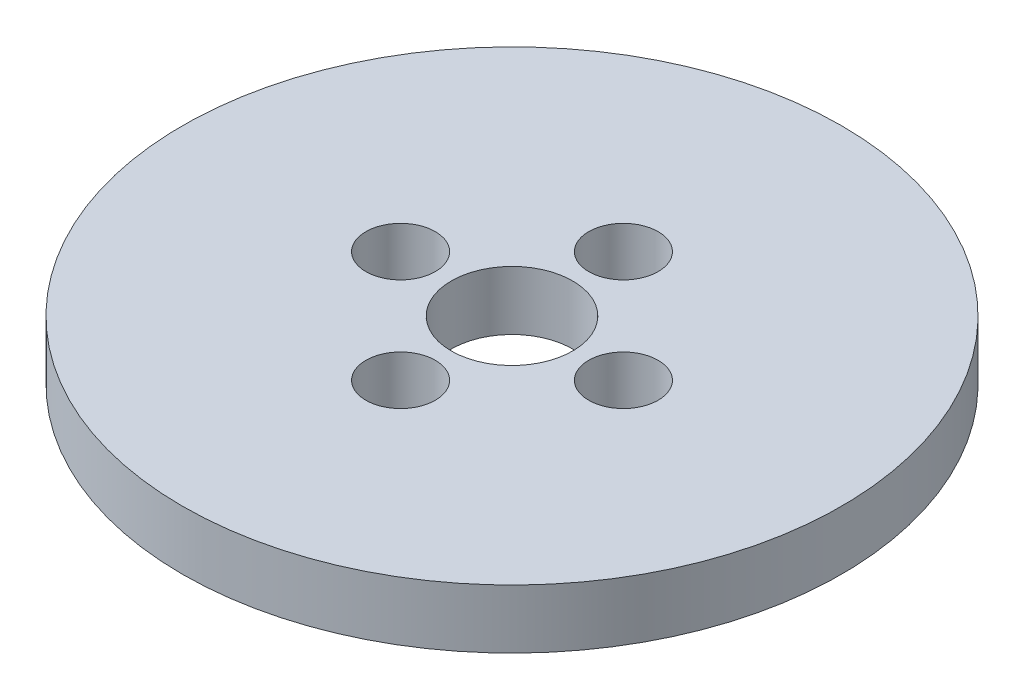
ISO-10303-21;
HEADER;
FILE_DESCRIPTION(('STEP AP214'),'2;1');
FILE_NAME('part.step','',(''),(''),'','','');
FILE_SCHEMA(('AUTOMOTIVE_DESIGN { 1 0 10303 214 1 1 1 1 }'));
ENDSEC;
DATA;
#1=APPLICATION_CONTEXT('core data for automotive mechanical design processes');
#2=APPLICATION_PROTOCOL_DEFINITION('international standard','automotive_design',2000,#1);
#3=PRODUCT_CONTEXT('',#1,'mechanical');
#4=PRODUCT('Part','Part','',(#3));
#5=PRODUCT_RELATED_PRODUCT_CATEGORY('part','',(#4));
#6=PRODUCT_DEFINITION_FORMATION('','',#4);
#7=PRODUCT_DEFINITION_CONTEXT('part definition',#1,'design');
#8=PRODUCT_DEFINITION('design','',#6,#7);
#9=PRODUCT_DEFINITION_SHAPE('','',#8);
#10=(LENGTH_UNIT() NAMED_UNIT(*) SI_UNIT(.MILLI.,.METRE.));
#11=(NAMED_UNIT(*) PLANE_ANGLE_UNIT() SI_UNIT($,.RADIAN.));
#12=(NAMED_UNIT(*) SI_UNIT($,.STERADIAN.) SOLID_ANGLE_UNIT());
#13=UNCERTAINTY_MEASURE_WITH_UNIT(LENGTH_MEASURE(1.E-05),#10,'distance_accuracy_value','');
#14=(GEOMETRIC_REPRESENTATION_CONTEXT(3) GLOBAL_UNCERTAINTY_ASSIGNED_CONTEXT((#13)) GLOBAL_UNIT_ASSIGNED_CONTEXT((#10,
#11,#12)) REPRESENTATION_CONTEXT('',''));
#15=CARTESIAN_POINT('',(0.,0.,0.));
#16=DIRECTION('',(0.,0.,1.));
#17=DIRECTION('',(1.,0.,0.));
#18=AXIS2_PLACEMENT_3D('',#15,#16,#17);
#19=CARTESIAN_POINT('',(0.,17.,0.));
#20=DIRECTION('',(0.,-1.,0.));
#21=DIRECTION('',(0.,0.,-1.));
#22=AXIS2_PLACEMENT_3D('',#19,#20,#21);
#23=CYLINDRICAL_SURFACE('',#22,95.);
#24=CARTESIAN_POINT('',(0.,17.,0.));
#25=DIRECTION('',(0.,1.,0.));
#26=DIRECTION('',(0.,0.,1.));
#27=AXIS2_PLACEMENT_3D('',#24,#25,#26);
#28=CIRCLE('',#27,95.);
#29=CARTESIAN_POINT('',(0.,17.,95.));
#30=VERTEX_POINT('',#29);
#31=EDGE_CURVE('E10',#30,#30,#28,.T.);
#32=ORIENTED_EDGE('',*,*,#31,.F.);
#33=EDGE_LOOP('',(#32));
#34=FACE_BOUND('',#33,.T.);
#35=CARTESIAN_POINT('',(0.,0.,0.));
#36=DIRECTION('',(0.,1.,0.));
#37=DIRECTION('',(0.,0.,1.));
#38=AXIS2_PLACEMENT_3D('',#35,#36,#37);
#39=CIRCLE('',#38,95.);
#40=CARTESIAN_POINT('',(0.,0.,95.));
#41=VERTEX_POINT('',#40);
#42=EDGE_CURVE('E37',#41,#41,#39,.T.);
#43=ORIENTED_EDGE('',*,*,#42,.T.);
#44=EDGE_LOOP('',(#43));
#45=FACE_BOUND('',#44,.T.);
#46=ADVANCED_FACE('F40',(#34,#45),#23,.T.);
#47=CARTESIAN_POINT('',(0.,17.,0.));
#48=DIRECTION('',(0.,1.,0.));
#49=DIRECTION('',(0.,0.,1.));
#50=AXIS2_PLACEMENT_3D('',#47,#48,#49);
#51=PLANE('',#50);
#52=CARTESIAN_POINT('',(1.12131820798127E-13,17.,32.1158299059622));
#53=DIRECTION('',(0.,1.,0.));
#54=DIRECTION('',(1.,0.,0.));
#55=AXIS2_PLACEMENT_3D('',#52,#53,#54);
#56=CIRCLE('',#55,10.);
#57=CARTESIAN_POINT('',(10.0000000000001,17.,32.1158299059622));
#58=VERTEX_POINT('',#57);
#59=EDGE_CURVE('E71',#58,#58,#56,.T.);
#60=ORIENTED_EDGE('',*,*,#59,.F.);
#61=EDGE_LOOP('',(#60));
#62=FACE_BOUND('',#61,.T.);
#63=CARTESIAN_POINT('',(32.1158299059622,17.,0.));
#64=DIRECTION('',(0.,1.,0.));
#65=DIRECTION('',(0.,0.,-1.));
#66=AXIS2_PLACEMENT_3D('',#63,#64,#65);
#67=CIRCLE('',#66,10.);
#68=CARTESIAN_POINT('',(32.1158299059622,17.,-10.));
#69=VERTEX_POINT('',#68);
#70=EDGE_CURVE('E70',#69,#69,#67,.T.);
#71=ORIENTED_EDGE('',*,*,#70,.F.);
#72=EDGE_LOOP('',(#71));
#73=FACE_BOUND('',#72,.T.);
#74=CARTESIAN_POINT('',(-3.36395462394382E-13,17.,-32.1158299059622));
#75=DIRECTION('',(0.,1.,0.));
#76=DIRECTION('',(-1.,0.,0.));
#77=AXIS2_PLACEMENT_3D('',#74,#75,#76);
#78=CIRCLE('',#77,10.);
#79=CARTESIAN_POINT('',(-10.0000000000003,17.,-32.1158299059621));
#80=VERTEX_POINT('',#79);
#81=EDGE_CURVE('E61',#80,#80,#78,.T.);
#82=ORIENTED_EDGE('',*,*,#81,.F.);
#83=EDGE_LOOP('',(#82));
#84=FACE_BOUND('',#83,.T.);
#85=CARTESIAN_POINT('',(-32.1158299059622,17.,0.));
#86=DIRECTION('',(0.,1.,0.));
#87=DIRECTION('',(0.,0.,1.));
#88=AXIS2_PLACEMENT_3D('',#85,#86,#87);
#89=CIRCLE('',#88,10.);
#90=CARTESIAN_POINT('',(-32.1158299059622,17.,10.));
#91=VERTEX_POINT('',#90);
#92=EDGE_CURVE('E54',#91,#91,#89,.T.);
#93=ORIENTED_EDGE('',*,*,#92,.F.);
#94=EDGE_LOOP('',(#93));
#95=FACE_BOUND('',#94,.T.);
#96=CARTESIAN_POINT('',(0.,17.,0.));
#97=DIRECTION('',(0.,1.,0.));
#98=DIRECTION('',(0.,0.,1.));
#99=AXIS2_PLACEMENT_3D('',#96,#97,#98);
#100=CIRCLE('',#99,17.5);
#101=CARTESIAN_POINT('',(0.,17.,17.5));
#102=VERTEX_POINT('',#101);
#103=EDGE_CURVE('E50',#102,#102,#100,.T.);
#104=ORIENTED_EDGE('',*,*,#103,.F.);
#105=EDGE_LOOP('',(#104));
#106=FACE_BOUND('',#105,.T.);
#107=ORIENTED_EDGE('',*,*,#31,.T.);
#108=EDGE_LOOP('',(#107));
#109=FACE_BOUND('',#108,.T.);
#110=ADVANCED_FACE('F86',(#62,#73,#84,#95,#106,#109),#51,.T.);
#111=CARTESIAN_POINT('',(0.,0.,0.));
#112=DIRECTION('',(0.,1.,0.));
#113=DIRECTION('',(0.,0.,1.));
#114=AXIS2_PLACEMENT_3D('',#111,#112,#113);
#115=PLANE('',#114);
#116=CARTESIAN_POINT('',(0.,0.,0.));
#117=DIRECTION('',(0.,1.,0.));
#118=DIRECTION('',(0.,0.,1.));
#119=AXIS2_PLACEMENT_3D('',#116,#117,#118);
#120=CIRCLE('',#119,17.5);
#121=CARTESIAN_POINT('',(0.,0.,17.5));
#122=VERTEX_POINT('',#121);
#123=EDGE_CURVE('E47',#122,#122,#120,.T.);
#124=ORIENTED_EDGE('',*,*,#123,.T.);
#125=EDGE_LOOP('',(#124));
#126=FACE_BOUND('',#125,.T.);
#127=ORIENTED_EDGE('',*,*,#42,.F.);
#128=EDGE_LOOP('',(#127));
#129=FACE_BOUND('',#128,.T.);
#130=ADVANCED_FACE('F93',(#126,#129),#115,.F.);
#131=CARTESIAN_POINT('',(0.,17.,0.));
#132=DIRECTION('',(0.,-1.,0.));
#133=DIRECTION('',(0.,0.,-1.));
#134=AXIS2_PLACEMENT_3D('',#131,#132,#133);
#135=CYLINDRICAL_SURFACE('',#134,17.5);
#136=ORIENTED_EDGE('',*,*,#103,.T.);
#137=EDGE_LOOP('',(#136));
#138=FACE_BOUND('',#137,.T.);
#139=ORIENTED_EDGE('',*,*,#123,.F.);
#140=EDGE_LOOP('',(#139));
#141=FACE_BOUND('',#140,.T.);
#142=ADVANCED_FACE('F101',(#138,#141),#135,.F.);
#143=CARTESIAN_POINT('',(-32.1158299059622,0.565419790112157,0.));
#144=DIRECTION('',(0.,1.,0.));
#145=DIRECTION('',(0.,0.,1.));
#146=AXIS2_PLACEMENT_3D('',#143,#144,#145);
#147=CYLINDRICAL_SURFACE('',#146,10.);
#148=CARTESIAN_POINT('',(-32.1158299059622,0.565419790112157,0.));
#149=DIRECTION('',(0.,1.,0.));
#150=DIRECTION('',(0.,0.,1.));
#151=AXIS2_PLACEMENT_3D('',#148,#149,#150);
#152=CIRCLE('',#151,10.);
#153=CARTESIAN_POINT('',(-32.1158299059622,0.565419790112157,10.));
#154=VERTEX_POINT('',#153);
#155=EDGE_CURVE('E55',#154,#154,#152,.T.);
#156=ORIENTED_EDGE('',*,*,#155,.F.);
#157=EDGE_LOOP('',(#156));
#158=FACE_BOUND('',#157,.T.);
#159=ORIENTED_EDGE('',*,*,#92,.T.);
#160=EDGE_LOOP('',(#159));
#161=FACE_BOUND('',#160,.T.);
#162=ADVANCED_FACE('F102',(#158,#161),#147,.F.);
#163=CARTESIAN_POINT('',(-32.1158299059622,0.565419790112157,0.));
#164=DIRECTION('',(0.,1.,0.));
#165=DIRECTION('',(0.,0.,1.));
#166=AXIS2_PLACEMENT_3D('',#163,#164,#165);
#167=PLANE('',#166);
#168=ORIENTED_EDGE('',*,*,#155,.T.);
#169=EDGE_LOOP('',(#168));
#170=FACE_BOUND('',#169,.T.);
#171=ADVANCED_FACE('F133',(#170),#167,.T.);
#172=CARTESIAN_POINT('',(-3.36395462394382E-13,0.565419790112157,-32.1158299059622));
#173=DIRECTION('',(0.,1.,0.));
#174=DIRECTION('',(0.,0.,1.));
#175=AXIS2_PLACEMENT_3D('',#172,#173,#174);
#176=CYLINDRICAL_SURFACE('',#175,10.);
#177=CARTESIAN_POINT('',(-3.36395462394382E-13,0.565419790112157,-32.1158299059622));
#178=DIRECTION('',(0.,1.,0.));
#179=DIRECTION('',(-1.,0.,0.));
#180=AXIS2_PLACEMENT_3D('',#177,#178,#179);
#181=CIRCLE('',#180,10.);
#182=CARTESIAN_POINT('',(-10.0000000000003,0.565419790112157,-32.1158299059621));
#183=VERTEX_POINT('',#182);
#184=EDGE_CURVE('E63',#183,#183,#181,.T.);
#185=ORIENTED_EDGE('',*,*,#184,.F.);
#186=EDGE_LOOP('',(#185));
#187=FACE_BOUND('',#186,.T.);
#188=ORIENTED_EDGE('',*,*,#81,.T.);
#189=EDGE_LOOP('',(#188));
#190=FACE_BOUND('',#189,.T.);
#191=ADVANCED_FACE('F142',(#187,#190),#176,.F.);
#192=CARTESIAN_POINT('',(-3.36395462394382E-13,0.565419790112157,-32.1158299059622));
#193=DIRECTION('',(0.,1.,0.));
#194=DIRECTION('',(-1.,0.,0.));
#195=AXIS2_PLACEMENT_3D('',#192,#193,#194);
#196=PLANE('',#195);
#197=ORIENTED_EDGE('',*,*,#184,.T.);
#198=EDGE_LOOP('',(#197));
#199=FACE_BOUND('',#198,.T.);
#200=ADVANCED_FACE('F156',(#199),#196,.T.);
#201=CARTESIAN_POINT('',(32.1158299059622,0.565419790112157,0.));
#202=DIRECTION('',(0.,1.,0.));
#203=DIRECTION('',(0.,0.,1.));
#204=AXIS2_PLACEMENT_3D('',#201,#202,#203);
#205=CYLINDRICAL_SURFACE('',#204,10.);
#206=CARTESIAN_POINT('',(32.1158299059622,0.565419790112157,0.));
#207=DIRECTION('',(0.,1.,0.));
#208=DIRECTION('',(0.,0.,-1.));
#209=AXIS2_PLACEMENT_3D('',#206,#207,#208);
#210=CIRCLE('',#209,10.);
#211=CARTESIAN_POINT('',(32.1158299059622,0.565419790112157,-10.));
#212=VERTEX_POINT('',#211);
#213=EDGE_CURVE('E69',#212,#212,#210,.T.);
#214=ORIENTED_EDGE('',*,*,#213,.F.);
#215=EDGE_LOOP('',(#214));
#216=FACE_BOUND('',#215,.T.);
#217=ORIENTED_EDGE('',*,*,#70,.T.);
#218=EDGE_LOOP('',(#217));
#219=FACE_BOUND('',#218,.T.);
#220=ADVANCED_FACE('F164',(#216,#219),#205,.F.);
#221=CARTESIAN_POINT('',(32.1158299059622,0.565419790112157,0.));
#222=DIRECTION('',(0.,1.,0.));
#223=DIRECTION('',(0.,0.,-1.));
#224=AXIS2_PLACEMENT_3D('',#221,#222,#223);
#225=PLANE('',#224);
#226=ORIENTED_EDGE('',*,*,#213,.T.);
#227=EDGE_LOOP('',(#226));
#228=FACE_BOUND('',#227,.T.);
#229=ADVANCED_FACE('F83',(#228),#225,.T.);
#230=CARTESIAN_POINT('',(1.12131820798127E-13,0.565419790112157,32.1158299059622));
#231=DIRECTION('',(0.,1.,0.));
#232=DIRECTION('',(0.,0.,1.));
#233=AXIS2_PLACEMENT_3D('',#230,#231,#232);
#234=CYLINDRICAL_SURFACE('',#233,10.);
#235=CARTESIAN_POINT('',(1.12131820798127E-13,0.565419790112157,32.1158299059622));
#236=DIRECTION('',(0.,1.,0.));
#237=DIRECTION('',(1.,0.,0.));
#238=AXIS2_PLACEMENT_3D('',#235,#236,#237);
#239=CIRCLE('',#238,10.);
#240=CARTESIAN_POINT('',(10.0000000000001,0.565419790112157,32.1158299059622));
#241=VERTEX_POINT('',#240);
#242=EDGE_CURVE('E59',#241,#241,#239,.T.);
#243=ORIENTED_EDGE('',*,*,#242,.F.);
#244=EDGE_LOOP('',(#243));
#245=FACE_BOUND('',#244,.T.);
#246=ORIENTED_EDGE('',*,*,#59,.T.);
#247=EDGE_LOOP('',(#246));
#248=FACE_BOUND('',#247,.T.);
#249=ADVANCED_FACE('F81',(#245,#248),#234,.F.);
#250=CARTESIAN_POINT('',(1.12131820798127E-13,0.565419790112157,32.1158299059622));
#251=DIRECTION('',(0.,1.,0.));
#252=DIRECTION('',(1.,0.,0.));
#253=AXIS2_PLACEMENT_3D('',#250,#251,#252);
#254=PLANE('',#253);
#255=ORIENTED_EDGE('',*,*,#242,.T.);
#256=EDGE_LOOP('',(#255));
#257=FACE_BOUND('',#256,.T.);
#258=ADVANCED_FACE('F78',(#257),#254,.T.);
#259=CLOSED_SHELL('',(#46,#110,#130,#142,#162,#171,#191,#200,#220,#229,#249,#258));
#260=MANIFOLD_SOLID_BREP('B2',#259);
#261=ADVANCED_BREP_SHAPE_REPRESENTATION('',(#18,#260),#14);
#262=SHAPE_DEFINITION_REPRESENTATION(#9,#261);
ENDSEC;
END-ISO-10303-21;
